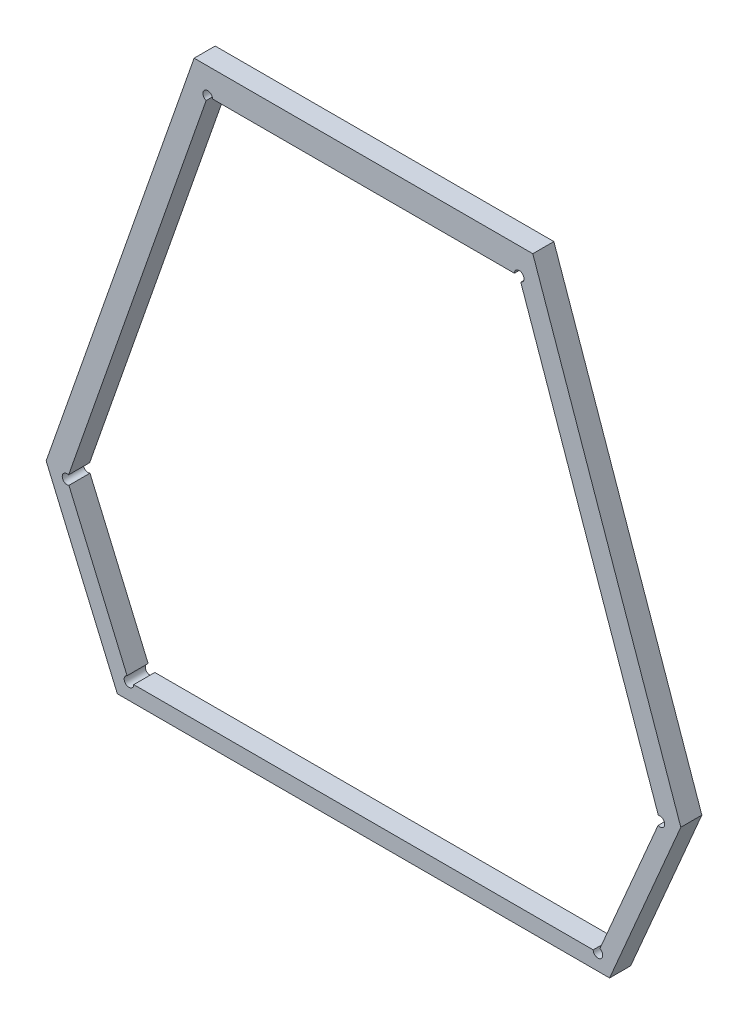
ISO-10303-21;
HEADER;
FILE_DESCRIPTION(('STEP AP214'),'2;1');
FILE_NAME('part.step','',(''),(''),'','','');
FILE_SCHEMA(('AUTOMOTIVE_DESIGN { 1 0 10303 214 1 1 1 1 }'));
ENDSEC;
DATA;
#1=APPLICATION_CONTEXT('core data for automotive mechanical design processes');
#2=APPLICATION_PROTOCOL_DEFINITION('international standard','automotive_design',2000,#1);
#3=PRODUCT_CONTEXT('',#1,'mechanical');
#4=PRODUCT('Part','Part','',(#3));
#5=PRODUCT_RELATED_PRODUCT_CATEGORY('part','',(#4));
#6=PRODUCT_DEFINITION_FORMATION('','',#4);
#7=PRODUCT_DEFINITION_CONTEXT('part definition',#1,'design');
#8=PRODUCT_DEFINITION('design','',#6,#7);
#9=PRODUCT_DEFINITION_SHAPE('','',#8);
#10=(LENGTH_UNIT() NAMED_UNIT(*) SI_UNIT(.MILLI.,.METRE.));
#11=(NAMED_UNIT(*) PLANE_ANGLE_UNIT() SI_UNIT($,.RADIAN.));
#12=(NAMED_UNIT(*) SI_UNIT($,.STERADIAN.) SOLID_ANGLE_UNIT());
#13=UNCERTAINTY_MEASURE_WITH_UNIT(LENGTH_MEASURE(1.E-05),#10,'distance_accuracy_value','');
#14=(GEOMETRIC_REPRESENTATION_CONTEXT(3) GLOBAL_UNCERTAINTY_ASSIGNED_CONTEXT((#13)) GLOBAL_UNIT_ASSIGNED_CONTEXT((#10,
#11,#12)) REPRESENTATION_CONTEXT('',''));
#15=CARTESIAN_POINT('',(0.,0.,0.));
#16=DIRECTION('',(0.,0.,1.));
#17=DIRECTION('',(1.,0.,0.));
#18=AXIS2_PLACEMENT_3D('',#15,#16,#17);
#19=CARTESIAN_POINT('',(-1.3307444469272,-1.3374481361952,0.00415));
#20=DIRECTION('',(0.,0.,1.));
#21=DIRECTION('',(1.,0.,0.));
#22=AXIS2_PLACEMENT_3D('',#19,#20,#21);
#23=PLANE('',#22);
#24=DIRECTION('',(-1.,0.,0.));
#25=VECTOR('',#24,1.);
#26=CARTESIAN_POINT('',(-1.3042082331991,-1.2877662252089,0.00415));
#27=LINE('',#26,#25);
#28=CARTESIAN_POINT('',(-1.3042082331991,-1.2877662252089,0.00415));
#29=VERTEX_POINT('',#28);
#30=CARTESIAN_POINT('',(-1.3572806606553,-1.2877662252089,0.00415));
#31=VERTEX_POINT('',#30);
#32=EDGE_CURVE('E11',#29,#31,#27,.T.);
#33=ORIENTED_EDGE('',*,*,#32,.T.);
#34=DIRECTION('',(-0.330395456277163,-0.943842594118005,0.));
#35=VECTOR('',#34,1.);
#36=CARTESIAN_POINT('',(-1.3572806606553,-1.2877662252089,0.00415));
#37=LINE('',#36,#35);
#38=CARTESIAN_POINT('',(-1.3804697660534,-1.3540106755437,0.00415));
#39=VERTEX_POINT('',#38);
#40=EDGE_CURVE('E24',#31,#39,#37,.T.);
#41=ORIENTED_EDGE('',*,*,#40,.T.);
#42=DIRECTION('',(0.393910865008948,-0.919148644359498,0.));
#43=VECTOR('',#42,1.);
#44=CARTESIAN_POINT('',(-1.3804697660534,-1.3540106755437,0.00415));
#45=LINE('',#44,#43);
#46=CARTESIAN_POINT('',(-1.3693129819663,-1.3800438314681,0.00415));
#47=VERTEX_POINT('',#46);
#48=EDGE_CURVE('E160',#39,#47,#45,.T.);
#49=ORIENTED_EDGE('',*,*,#48,.T.);
#50=DIRECTION('',(1.,0.,0.));
#51=VECTOR('',#50,1.);
#52=CARTESIAN_POINT('',(-1.3693129819663,-1.3800438314681,0.00415));
#53=LINE('',#52,#51);
#54=CARTESIAN_POINT('',(-1.2921759118881,-1.3800438314681,0.00415));
#55=VERTEX_POINT('',#54);
#56=EDGE_CURVE('E266',#47,#55,#53,.T.);
#57=ORIENTED_EDGE('',*,*,#56,.T.);
#58=DIRECTION('',(0.393910865008948,0.919148644359498,0.));
#59=VECTOR('',#58,1.);
#60=CARTESIAN_POINT('',(-1.2921759118881,-1.3800438314681,0.00415));
#61=LINE('',#60,#59);
#62=CARTESIAN_POINT('',(-1.281019127801,-1.3540106755437,0.00415));
#63=VERTEX_POINT('',#62);
#64=EDGE_CURVE('E264',#55,#63,#61,.T.);
#65=ORIENTED_EDGE('',*,*,#64,.T.);
#66=DIRECTION('',(-0.330395456277163,0.943842594118005,0.));
#67=VECTOR('',#66,1.);
#68=CARTESIAN_POINT('',(-1.281019127801,-1.3540106755437,0.00415));
#69=LINE('',#68,#67);
#70=EDGE_CURVE('E262',#63,#29,#69,.T.);
#71=ORIENTED_EDGE('',*,*,#70,.T.);
#72=EDGE_LOOP('',(#33,#41,#49,#57,#65,#71));
#73=FACE_BOUND('',#72,.T.);
#74=DIRECTION('',(-1.,0.,0.));
#75=VECTOR('',#74,1.);
#76=CARTESIAN_POINT('',(-1.3487428118905,-1.3775098681317,0.00415));
#77=LINE('',#76,#75);
#78=CARTESIAN_POINT('',(-1.2947477170004,-1.3775098681317,0.00415));
#79=VERTEX_POINT('',#78);
#80=CARTESIAN_POINT('',(-1.3667411768539,-1.3775098681317,0.00415));
#81=VERTEX_POINT('',#80);
#82=EDGE_CURVE('E260',#79,#81,#77,.T.);
#83=ORIENTED_EDGE('',*,*,#82,.T.);
#84=CARTESIAN_POINT('',(-1.3674911768539,-1.3775098681317,0.00415));
#85=DIRECTION('',(0.,0.,-1.));
#86=DIRECTION('',(0.393910865009024,-0.919148644359465,0.));
#87=AXIS2_PLACEMENT_3D('',#84,#85,#86);
#88=CIRCLE('',#87,0.000749999999999995);
#89=CARTESIAN_POINT('',(-1.3677866100027,-1.3768205066485,0.00415));
#90=VERTEX_POINT('',#89);
#91=EDGE_CURVE('E258',#81,#90,#88,.T.);
#92=ORIENTED_EDGE('',*,*,#91,.T.);
#93=DIRECTION('',(-0.393910865008941,0.919148644359501,0.));
#94=VECTOR('',#93,1.);
#95=CARTESIAN_POINT('',(-1.3765984412098,-1.3562590461054,0.00415));
#96=LINE('',#95,#94);
#97=CARTESIAN_POINT('',(-1.3769026838634,-1.3555491285898,0.00415));
#98=VERTEX_POINT('',#97);
#99=EDGE_CURVE('E256',#90,#98,#96,.T.);
#100=ORIENTED_EDGE('',*,*,#99,.T.);
#101=CARTESIAN_POINT('',(-1.3771981170122,-1.3548597671065,0.00415));
#102=DIRECTION('',(0.,0.,-1.));
#103=DIRECTION('',(-0.330395456277302,-0.943842594117956,0.));
#104=AXIS2_PLACEMENT_3D('',#101,#102,#103);
#105=CIRCLE('',#104,0.000749999999999991);
#106=CARTESIAN_POINT('',(-1.37695032042,-1.354151885161,0.00415));
#107=VERTEX_POINT('',#106);
#108=EDGE_CURVE('E254',#98,#107,#105,.T.);
#109=ORIENTED_EDGE('',*,*,#108,.T.);
#110=DIRECTION('',(0.33039545627716,0.943842594118006,0.));
#111=VECTOR('',#110,1.);
#112=CARTESIAN_POINT('',(-1.3610453573101,-1.3087160858611,0.00415));
#113=LINE('',#112,#111);
#114=CARTESIAN_POINT('',(-1.3553931997035,-1.2925695348222,0.00415));
#115=VERTEX_POINT('',#114);
#116=EDGE_CURVE('E252',#107,#115,#113,.T.);
#117=ORIENTED_EDGE('',*,*,#116,.T.);
#118=CARTESIAN_POINT('',(-1.3551454031113,-1.2918616528766,0.00415));
#119=DIRECTION('',(0.,0.,-1.));
#120=DIRECTION('',(-1.,0.,0.));
#121=AXIS2_PLACEMENT_3D('',#118,#119,#120);
#122=CIRCLE('',#121,0.00075000000000001);
#123=CARTESIAN_POINT('',(-1.3543954031112,-1.2918616528766,0.00415));
#124=VERTEX_POINT('',#123);
#125=EDGE_CURVE('E250',#115,#124,#122,.T.);
#126=ORIENTED_EDGE('',*,*,#125,.T.);
#127=DIRECTION('',(1.,0.,0.));
#128=VECTOR('',#127,1.);
#129=CARTESIAN_POINT('',(-1.3189189688351,-1.2918616528766,0.00415));
#130=LINE('',#129,#128);
#131=CARTESIAN_POINT('',(-1.3070934907431,-1.2918616528766,0.00415));
#132=VERTEX_POINT('',#131);
#133=EDGE_CURVE('E248',#124,#132,#130,.T.);
#134=ORIENTED_EDGE('',*,*,#133,.T.);
#135=CARTESIAN_POINT('',(-1.3063434907431,-1.2918616528766,0.00415));
#136=DIRECTION('',(0.,0.,-1.));
#137=DIRECTION('',(-0.330395456277186,0.943842594117997,0.));
#138=AXIS2_PLACEMENT_3D('',#135,#136,#137);
#139=CIRCLE('',#138,0.000750000000000008);
#140=CARTESIAN_POINT('',(-1.3060956941509,-1.2925695348222,0.00415));
#141=VERTEX_POINT('',#140);
#142=EDGE_CURVE('E246',#132,#141,#139,.T.);
#143=ORIENTED_EDGE('',*,*,#142,.T.);
#144=DIRECTION('',(0.33039545627716,-0.943842594118006,0.));
#145=VECTOR('',#144,1.);
#146=CARTESIAN_POINT('',(-1.289664976186,-1.3395072610305,0.00415));
#147=LINE('',#146,#145);
#148=CARTESIAN_POINT('',(-1.2845385734344,-1.354151885161,0.00415));
#149=VERTEX_POINT('',#148);
#150=EDGE_CURVE('E244',#141,#149,#147,.T.);
#151=ORIENTED_EDGE('',*,*,#150,.T.);
#152=CARTESIAN_POINT('',(-1.2842907768421,-1.3548597671065,0.00415));
#153=DIRECTION('',(0.,0.,-1.));
#154=DIRECTION('',(0.39391086500889,0.919148644359522,0.));
#155=AXIS2_PLACEMENT_3D('',#152,#153,#154);
#156=CIRCLE('',#155,0.000749999999999999);
#157=CARTESIAN_POINT('',(-1.2845862099909,-1.3555491285898,0.00415));
#158=VERTEX_POINT('',#157);
#159=EDGE_CURVE('E242',#149,#158,#156,.T.);
#160=ORIENTED_EDGE('',*,*,#159,.T.);
#161=DIRECTION('',(-0.393910865008941,-0.919148644359501,0.));
#162=VECTOR('',#161,1.);
#163=CARTESIAN_POINT('',(-1.2894484895749,-1.3668947351347,0.00415));
#164=LINE('',#163,#162);
#165=CARTESIAN_POINT('',(-1.2937022838517,-1.3768205066485,0.00415));
#166=VERTEX_POINT('',#165);
#167=EDGE_CURVE('E240',#158,#166,#164,.T.);
#168=ORIENTED_EDGE('',*,*,#167,.T.);
#169=CARTESIAN_POINT('',(-1.2939977170004,-1.3775098681317,0.00415));
#170=DIRECTION('',(0.,0.,-1.));
#171=DIRECTION('',(1.,0.,0.));
#172=AXIS2_PLACEMENT_3D('',#169,#170,#171);
#173=CIRCLE('',#172,0.000750000000000004);
#174=EDGE_CURVE('E237',#166,#79,#173,.T.);
#175=ORIENTED_EDGE('',*,*,#174,.T.);
#176=EDGE_LOOP('',(#83,#92,#100,#109,#117,#126,#134,#143,#151,#160,#168,#175));
#177=FACE_BOUND('',#176,.T.);
#178=ADVANCED_FACE('F17',(#73,#177),#23,.T.);
#179=CARTESIAN_POINT('',(-1.2939977170004,-1.3775098681317,0.00115));
#180=DIRECTION('',(0.,0.,1.));
#181=DIRECTION('',(0.550494838754632,-0.834838566732821,0.));
#182=AXIS2_PLACEMENT_3D('',#179,#180,#181);
#183=CYLINDRICAL_SURFACE('',#182,0.000750000000000004);
#184=DIRECTION('',(0.,0.,1.));
#185=VECTOR('',#184,1.);
#186=CARTESIAN_POINT('',(-1.2937022838517,-1.3768205066485,0.00115));
#187=LINE('',#186,#185);
#188=CARTESIAN_POINT('',(-1.2937022838517,-1.3768205066485,0.00085));
#189=VERTEX_POINT('',#188);
#190=EDGE_CURVE('E234',#189,#166,#187,.T.);
#191=ORIENTED_EDGE('',*,*,#190,.F.);
#192=CARTESIAN_POINT('',(-1.2939977170004,-1.3775098681317,0.00085));
#193=DIRECTION('',(0.,0.,1.));
#194=DIRECTION('',(-1.,0.,0.));
#195=AXIS2_PLACEMENT_3D('',#192,#193,#194);
#196=CIRCLE('',#195,0.000750000000000004);
#197=CARTESIAN_POINT('',(-1.2947477170004,-1.3775098681317,0.00085));
#198=VERTEX_POINT('',#197);
#199=EDGE_CURVE('E232',#198,#189,#196,.T.);
#200=ORIENTED_EDGE('',*,*,#199,.F.);
#201=DIRECTION('',(0.,0.,-1.));
#202=VECTOR('',#201,1.);
#203=CARTESIAN_POINT('',(-1.2947477170004,-1.3775098681317,0.00115));
#204=LINE('',#203,#202);
#205=EDGE_CURVE('E230',#79,#198,#204,.T.);
#206=ORIENTED_EDGE('',*,*,#205,.F.);
#207=ORIENTED_EDGE('',*,*,#174,.F.);
#208=EDGE_LOOP('',(#191,#200,#206,#207));
#209=FACE_BOUND('',#208,.T.);
#210=ADVANCED_FACE('F301',(#209),#183,.F.);
#211=CARTESIAN_POINT('',(-1.3771981170122,-1.3548597671065,0.00115));
#212=DIRECTION('',(0.,0.,1.));
#213=DIRECTION('',(-1.,0.,0.));
#214=AXIS2_PLACEMENT_3D('',#211,#212,#213);
#215=CYLINDRICAL_SURFACE('',#214,0.000749999999999991);
#216=DIRECTION('',(0.,0.,-1.));
#217=VECTOR('',#216,1.);
#218=CARTESIAN_POINT('',(-1.37695032042,-1.354151885161,0.00115));
#219=LINE('',#218,#217);
#220=CARTESIAN_POINT('',(-1.37695032042,-1.354151885161,0.00085));
#221=VERTEX_POINT('',#220);
#222=EDGE_CURVE('E227',#107,#221,#219,.T.);
#223=ORIENTED_EDGE('',*,*,#222,.F.);
#224=ORIENTED_EDGE('',*,*,#108,.F.);
#225=DIRECTION('',(0.,0.,1.));
#226=VECTOR('',#225,1.);
#227=CARTESIAN_POINT('',(-1.3769026838634,-1.3555491285898,0.00115));
#228=LINE('',#227,#226);
#229=CARTESIAN_POINT('',(-1.3769026838634,-1.3555491285898,0.00085));
#230=VERTEX_POINT('',#229);
#231=EDGE_CURVE('E224',#230,#98,#228,.T.);
#232=ORIENTED_EDGE('',*,*,#231,.F.);
#233=CARTESIAN_POINT('',(-1.3771981170122,-1.3548597671065,0.00085));
#234=DIRECTION('',(0.,0.,1.));
#235=DIRECTION('',(-1.,0.,0.));
#236=AXIS2_PLACEMENT_3D('',#233,#234,#235);
#237=CIRCLE('',#236,0.000749999999999991);
#238=EDGE_CURVE('E222',#221,#230,#237,.T.);
#239=ORIENTED_EDGE('',*,*,#238,.F.);
#240=EDGE_LOOP('',(#223,#224,#232,#239));
#241=FACE_BOUND('',#240,.T.);
#242=ADVANCED_FACE('F305',(#241),#215,.F.);
#243=CARTESIAN_POINT('',(-1.3063434907431,-1.2918616528766,0.00115));
#244=DIRECTION('',(0.,0.,1.));
#245=DIRECTION('',(0.578621008831693,0.815596547404778,0.));
#246=AXIS2_PLACEMENT_3D('',#243,#244,#245);
#247=CYLINDRICAL_SURFACE('',#246,0.000750000000000008);
#248=DIRECTION('',(0.,0.,1.));
#249=VECTOR('',#248,1.);
#250=CARTESIAN_POINT('',(-1.3070934907431,-1.2918616528766,0.00115));
#251=LINE('',#250,#249);
#252=CARTESIAN_POINT('',(-1.3070934907431,-1.2918616528766,0.00085));
#253=VERTEX_POINT('',#252);
#254=EDGE_CURVE('E219',#253,#132,#251,.T.);
#255=ORIENTED_EDGE('',*,*,#254,.F.);
#256=CARTESIAN_POINT('',(-1.3063434907431,-1.2918616528766,0.00085));
#257=DIRECTION('',(0.,0.,1.));
#258=DIRECTION('',(-1.,0.,0.));
#259=AXIS2_PLACEMENT_3D('',#256,#257,#258);
#260=CIRCLE('',#259,0.000750000000000008);
#261=CARTESIAN_POINT('',(-1.3060956941509,-1.2925695348222,0.00085));
#262=VERTEX_POINT('',#261);
#263=EDGE_CURVE('E217',#262,#253,#260,.T.);
#264=ORIENTED_EDGE('',*,*,#263,.F.);
#265=DIRECTION('',(0.,0.,-1.));
#266=VECTOR('',#265,1.);
#267=CARTESIAN_POINT('',(-1.3060956941509,-1.2925695348222,0.00115));
#268=LINE('',#267,#266);
#269=EDGE_CURVE('E215',#141,#262,#268,.T.);
#270=ORIENTED_EDGE('',*,*,#269,.F.);
#271=ORIENTED_EDGE('',*,*,#142,.F.);
#272=EDGE_LOOP('',(#255,#264,#270,#271));
#273=FACE_BOUND('',#272,.T.);
#274=ADVANCED_FACE('F310',(#273),#247,.F.);
#275=CARTESIAN_POINT('',(-1.3551454031113,-1.2918616528766,0.00115));
#276=DIRECTION('',(0.,0.,1.));
#277=DIRECTION('',(-1.,0.,0.));
#278=AXIS2_PLACEMENT_3D('',#275,#276,#277);
#279=CYLINDRICAL_SURFACE('',#278,0.00075000000000001);
#280=DIRECTION('',(0.,0.,-1.));
#281=VECTOR('',#280,1.);
#282=CARTESIAN_POINT('',(-1.3543954031112,-1.2918616528766,0.00115));
#283=LINE('',#282,#281);
#284=CARTESIAN_POINT('',(-1.3543954031112,-1.2918616528766,0.00085));
#285=VERTEX_POINT('',#284);
#286=EDGE_CURVE('E212',#124,#285,#283,.T.);
#287=ORIENTED_EDGE('',*,*,#286,.F.);
#288=ORIENTED_EDGE('',*,*,#125,.F.);
#289=DIRECTION('',(0.,0.,1.));
#290=VECTOR('',#289,1.);
#291=CARTESIAN_POINT('',(-1.3553931997035,-1.2925695348222,0.00115));
#292=LINE('',#291,#290);
#293=CARTESIAN_POINT('',(-1.3553931997035,-1.2925695348222,0.00085));
#294=VERTEX_POINT('',#293);
#295=EDGE_CURVE('E209',#294,#115,#292,.T.);
#296=ORIENTED_EDGE('',*,*,#295,.F.);
#297=CARTESIAN_POINT('',(-1.3551454031113,-1.2918616528766,0.00085));
#298=DIRECTION('',(0.,0.,1.));
#299=DIRECTION('',(-1.,0.,0.));
#300=AXIS2_PLACEMENT_3D('',#297,#298,#299);
#301=CIRCLE('',#300,0.00075000000000001);
#302=EDGE_CURVE('E207',#285,#294,#301,.T.);
#303=ORIENTED_EDGE('',*,*,#302,.F.);
#304=EDGE_LOOP('',(#287,#288,#296,#303));
#305=FACE_BOUND('',#304,.T.);
#306=ADVANCED_FACE('F317',(#305),#279,.F.);
#307=CARTESIAN_POINT('',(-1.3674911768539,-1.3775098681317,0.00115));
#308=DIRECTION('',(0.,0.,1.));
#309=DIRECTION('',(-1.,0.,0.));
#310=AXIS2_PLACEMENT_3D('',#307,#308,#309);
#311=CYLINDRICAL_SURFACE('',#310,0.000749999999999995);
#312=DIRECTION('',(0.,0.,1.));
#313=VECTOR('',#312,1.);
#314=CARTESIAN_POINT('',(-1.3667411768539,-1.3775098681317,0.00115));
#315=LINE('',#314,#313);
#316=CARTESIAN_POINT('',(-1.3667411768539,-1.3775098681317,0.00085));
#317=VERTEX_POINT('',#316);
#318=EDGE_CURVE('E204',#317,#81,#315,.T.);
#319=ORIENTED_EDGE('',*,*,#318,.F.);
#320=CARTESIAN_POINT('',(-1.3674911768539,-1.3775098681317,0.00085));
#321=DIRECTION('',(0.,0.,1.));
#322=DIRECTION('',(-1.,0.,0.));
#323=AXIS2_PLACEMENT_3D('',#320,#321,#322);
#324=CIRCLE('',#323,0.000749999999999995);
#325=CARTESIAN_POINT('',(-1.3677866100027,-1.3768205066485,0.00085));
#326=VERTEX_POINT('',#325);
#327=EDGE_CURVE('E202',#326,#317,#324,.T.);
#328=ORIENTED_EDGE('',*,*,#327,.F.);
#329=DIRECTION('',(0.,0.,1.));
#330=VECTOR('',#329,1.);
#331=CARTESIAN_POINT('',(-1.3677866100027,-1.3768205066485,0.00115));
#332=LINE('',#331,#330);
#333=EDGE_CURVE('E199',#326,#90,#332,.T.);
#334=ORIENTED_EDGE('',*,*,#333,.T.);
#335=ORIENTED_EDGE('',*,*,#91,.F.);
#336=EDGE_LOOP('',(#319,#328,#334,#335));
#337=FACE_BOUND('',#336,.T.);
#338=ADVANCED_FACE('F321',(#337),#311,.F.);
#339=CARTESIAN_POINT('',(-1.2842907768421,-1.3548597671065,0.00115));
#340=DIRECTION('',(0.,0.,1.));
#341=DIRECTION('',(0.99941933162449,-0.0340734438420617,0.));
#342=AXIS2_PLACEMENT_3D('',#339,#340,#341);
#343=CYLINDRICAL_SURFACE('',#342,0.000749999999999999);
#344=DIRECTION('',(0.,0.,1.));
#345=VECTOR('',#344,1.);
#346=CARTESIAN_POINT('',(-1.2845385734344,-1.354151885161,0.00115));
#347=LINE('',#346,#345);
#348=CARTESIAN_POINT('',(-1.2845385734344,-1.354151885161,0.00085));
#349=VERTEX_POINT('',#348);
#350=EDGE_CURVE('E196',#349,#149,#347,.T.);
#351=ORIENTED_EDGE('',*,*,#350,.F.);
#352=CARTESIAN_POINT('',(-1.2842907768421,-1.3548597671065,0.00085));
#353=DIRECTION('',(0.,0.,1.));
#354=DIRECTION('',(-1.,0.,0.));
#355=AXIS2_PLACEMENT_3D('',#352,#353,#354);
#356=CIRCLE('',#355,0.000749999999999999);
#357=CARTESIAN_POINT('',(-1.2845862099909,-1.3555491285898,0.00085));
#358=VERTEX_POINT('',#357);
#359=EDGE_CURVE('E194',#358,#349,#356,.T.);
#360=ORIENTED_EDGE('',*,*,#359,.F.);
#361=DIRECTION('',(0.,0.,-1.));
#362=VECTOR('',#361,1.);
#363=CARTESIAN_POINT('',(-1.2845862099909,-1.3555491285898,0.00115));
#364=LINE('',#363,#362);
#365=EDGE_CURVE('E192',#158,#358,#364,.T.);
#366=ORIENTED_EDGE('',*,*,#365,.F.);
#367=ORIENTED_EDGE('',*,*,#159,.F.);
#368=EDGE_LOOP('',(#351,#360,#366,#367));
#369=FACE_BOUND('',#368,.T.);
#370=ADVANCED_FACE('F325',(#369),#343,.F.);
#371=CARTESIAN_POINT('',(-1.3771981170122,-1.3548597671065,0.00085));
#372=DIRECTION('',(-0.919148644359501,-0.393910865008941,0.));
#373=DIRECTION('',(0.393910865008941,-0.919148644359501,0.));
#374=AXIS2_PLACEMENT_3D('',#371,#372,#373);
#375=PLANE('',#374);
#376=ORIENTED_EDGE('',*,*,#231,.T.);
#377=ORIENTED_EDGE('',*,*,#99,.F.);
#378=ORIENTED_EDGE('',*,*,#333,.F.);
#379=DIRECTION('',(0.393910865008941,-0.919148644359501,0.));
#380=VECTOR('',#379,1.);
#381=CARTESIAN_POINT('',(-1.3771981170122,-1.3548597671065,0.00085));
#382=LINE('',#381,#380);
#383=EDGE_CURVE('E189',#230,#326,#382,.T.);
#384=ORIENTED_EDGE('',*,*,#383,.F.);
#385=EDGE_LOOP('',(#376,#377,#378,#384));
#386=FACE_BOUND('',#385,.T.);
#387=ADVANCED_FACE('F329',(#386),#375,.F.);
#388=CARTESIAN_POINT('',(-1.2939977170004,-1.3775098681317,0.00085));
#389=DIRECTION('',(0.,1.,0.));
#390=DIRECTION('',(-1.,0.,0.));
#391=AXIS2_PLACEMENT_3D('',#388,#389,#390);
#392=PLANE('',#391);
#393=ORIENTED_EDGE('',*,*,#205,.T.);
#394=DIRECTION('',(-1.,0.,0.));
#395=VECTOR('',#394,1.);
#396=CARTESIAN_POINT('',(-1.2939977170004,-1.3775098681317,0.00085));
#397=LINE('',#396,#395);
#398=EDGE_CURVE('E186',#198,#317,#397,.T.);
#399=ORIENTED_EDGE('',*,*,#398,.T.);
#400=ORIENTED_EDGE('',*,*,#318,.T.);
#401=ORIENTED_EDGE('',*,*,#82,.F.);
#402=EDGE_LOOP('',(#393,#399,#400,#401));
#403=FACE_BOUND('',#402,.T.);
#404=ADVANCED_FACE('F333',(#403),#392,.T.);
#405=CARTESIAN_POINT('',(-1.3016685363949,-1.3375636474539,0.00085));
#406=DIRECTION('',(0.,0.,1.));
#407=DIRECTION('',(1.,0.,0.));
#408=AXIS2_PLACEMENT_3D('',#405,#406,#407);
#409=PLANE('',#408);
#410=DIRECTION('',(-1.,0.,0.));
#411=VECTOR('',#410,1.);
#412=CARTESIAN_POINT('',(-1.3042082331991,-1.2877662252089,0.00085));
#413=LINE('',#412,#411);
#414=CARTESIAN_POINT('',(-1.3042082331991,-1.2877662252089,0.00085));
#415=VERTEX_POINT('',#414);
#416=CARTESIAN_POINT('',(-1.3572806606553,-1.2877662252089,0.00085));
#417=VERTEX_POINT('',#416);
#418=EDGE_CURVE('E184',#415,#417,#413,.T.);
#419=ORIENTED_EDGE('',*,*,#418,.F.);
#420=DIRECTION('',(-0.33039545627716,0.943842594118006,0.));
#421=VECTOR('',#420,1.);
#422=CARTESIAN_POINT('',(-1.281019127801,-1.3540106755437,0.00085));
#423=LINE('',#422,#421);
#424=CARTESIAN_POINT('',(-1.281019127801,-1.3540106755437,0.00085));
#425=VERTEX_POINT('',#424);
#426=EDGE_CURVE('E181',#425,#415,#423,.T.);
#427=ORIENTED_EDGE('',*,*,#426,.F.);
#428=DIRECTION('',(0.393910865008941,0.919148644359501,0.));
#429=VECTOR('',#428,1.);
#430=CARTESIAN_POINT('',(-1.2921759118881,-1.3800438314681,0.00085));
#431=LINE('',#430,#429);
#432=CARTESIAN_POINT('',(-1.2921759118881,-1.3800438314681,0.00085));
#433=VERTEX_POINT('',#432);
#434=EDGE_CURVE('E178',#433,#425,#431,.T.);
#435=ORIENTED_EDGE('',*,*,#434,.F.);
#436=DIRECTION('',(-1.,0.,0.));
#437=VECTOR('',#436,1.);
#438=CARTESIAN_POINT('',(-1.3307444469272,-1.3800438314681,0.00085));
#439=LINE('',#438,#437);
#440=CARTESIAN_POINT('',(-1.3693129819663,-1.3800438314681,0.00085));
#441=VERTEX_POINT('',#440);
#442=EDGE_CURVE('E145',#433,#441,#439,.T.);
#443=ORIENTED_EDGE('',*,*,#442,.T.);
#444=DIRECTION('',(-0.393910865008941,0.919148644359501,0.));
#445=VECTOR('',#444,1.);
#446=CARTESIAN_POINT('',(-1.3693129819663,-1.3800438314681,0.00085));
#447=LINE('',#446,#445);
#448=CARTESIAN_POINT('',(-1.3804697660534,-1.3540106755437,0.00085));
#449=VERTEX_POINT('',#448);
#450=EDGE_CURVE('E138',#441,#449,#447,.T.);
#451=ORIENTED_EDGE('',*,*,#450,.T.);
#452=DIRECTION('',(0.33039545627716,0.943842594118006,0.));
#453=VECTOR('',#452,1.);
#454=CARTESIAN_POINT('',(-1.3804697660534,-1.3540106755437,0.00085));
#455=LINE('',#454,#453);
#456=EDGE_CURVE('E142',#449,#417,#455,.T.);
#457=ORIENTED_EDGE('',*,*,#456,.T.);
#458=EDGE_LOOP('',(#419,#427,#435,#443,#451,#457));
#459=FACE_BOUND('',#458,.T.);
#460=ORIENTED_EDGE('',*,*,#199,.T.);
#461=DIRECTION('',(-0.393910865008941,-0.919148644359501,0.));
#462=VECTOR('',#461,1.);
#463=CARTESIAN_POINT('',(-1.2842907768421,-1.3548597671065,0.00085));
#464=LINE('',#463,#462);
#465=EDGE_CURVE('E156',#358,#189,#464,.T.);
#466=ORIENTED_EDGE('',*,*,#465,.F.);
#467=ORIENTED_EDGE('',*,*,#359,.T.);
#468=DIRECTION('',(0.330395456277161,-0.943842594118006,0.));
#469=VECTOR('',#468,1.);
#470=CARTESIAN_POINT('',(-1.3063434907431,-1.2918616528766,0.00085));
#471=LINE('',#470,#469);
#472=EDGE_CURVE('E172',#262,#349,#471,.T.);
#473=ORIENTED_EDGE('',*,*,#472,.F.);
#474=ORIENTED_EDGE('',*,*,#263,.T.);
#475=DIRECTION('',(1.,0.,0.));
#476=VECTOR('',#475,1.);
#477=CARTESIAN_POINT('',(-1.3307444469272,-1.2918616528766,0.00085));
#478=LINE('',#477,#476);
#479=EDGE_CURVE('E164',#285,#253,#478,.T.);
#480=ORIENTED_EDGE('',*,*,#479,.F.);
#481=ORIENTED_EDGE('',*,*,#302,.T.);
#482=DIRECTION('',(-0.330395456277161,-0.943842594118006,0.));
#483=VECTOR('',#482,1.);
#484=CARTESIAN_POINT('',(-1.3551454031113,-1.2918616528766,0.00085));
#485=LINE('',#484,#483);
#486=EDGE_CURVE('E161',#294,#221,#485,.T.);
#487=ORIENTED_EDGE('',*,*,#486,.T.);
#488=ORIENTED_EDGE('',*,*,#238,.T.);
#489=ORIENTED_EDGE('',*,*,#383,.T.);
#490=ORIENTED_EDGE('',*,*,#327,.T.);
#491=ORIENTED_EDGE('',*,*,#398,.F.);
#492=EDGE_LOOP('',(#460,#466,#467,#473,#474,#480,#481,#487,#488,#489,#490,#491));
#493=FACE_BOUND('',#492,.T.);
#494=ADVANCED_FACE('F140',(#459,#493),#409,.F.);
#495=CARTESIAN_POINT('',(-1.3063434907431,-1.2918616528766,0.00085));
#496=DIRECTION('',(-0.943842594118006,-0.330395456277161,0.));
#497=DIRECTION('',(0.330395456277161,-0.943842594118006,0.));
#498=AXIS2_PLACEMENT_3D('',#495,#496,#497);
#499=PLANE('',#498);
#500=ORIENTED_EDGE('',*,*,#269,.T.);
#501=ORIENTED_EDGE('',*,*,#472,.T.);
#502=ORIENTED_EDGE('',*,*,#350,.T.);
#503=ORIENTED_EDGE('',*,*,#150,.F.);
#504=EDGE_LOOP('',(#500,#501,#502,#503));
#505=FACE_BOUND('',#504,.T.);
#506=ADVANCED_FACE('F340',(#505),#499,.T.);
#507=CARTESIAN_POINT('',(-1.3804697660534,-1.3540106755437,0.00085));
#508=DIRECTION('',(0.943842594118006,-0.33039545627716,0.));
#509=DIRECTION('',(0.33039545627716,0.943842594118006,0.));
#510=AXIS2_PLACEMENT_3D('',#507,#508,#509);
#511=PLANE('',#510);
#512=ORIENTED_EDGE('',*,*,#456,.F.);
#513=DIRECTION('',(0.,0.,1.));
#514=VECTOR('',#513,1.);
#515=CARTESIAN_POINT('',(-1.3804697660534,-1.3540106755437,0.00085));
#516=LINE('',#515,#514);
#517=EDGE_CURVE('E154',#449,#39,#516,.T.);
#518=ORIENTED_EDGE('',*,*,#517,.T.);
#519=ORIENTED_EDGE('',*,*,#40,.F.);
#520=DIRECTION('',(0.,0.,1.));
#521=VECTOR('',#520,1.);
#522=CARTESIAN_POINT('',(-1.3572806606553,-1.2877662252089,0.00085));
#523=LINE('',#522,#521);
#524=EDGE_CURVE('E155',#417,#31,#523,.T.);
#525=ORIENTED_EDGE('',*,*,#524,.F.);
#526=EDGE_LOOP('',(#512,#518,#519,#525));
#527=FACE_BOUND('',#526,.T.);
#528=ADVANCED_FACE('F153',(#527),#511,.F.);
#529=CARTESIAN_POINT('',(-1.3693129819663,-1.3800438314681,0.00085));
#530=DIRECTION('',(0.919148644359501,0.393910865008941,0.));
#531=DIRECTION('',(-0.393910865008941,0.919148644359501,0.));
#532=AXIS2_PLACEMENT_3D('',#529,#530,#531);
#533=PLANE('',#532);
#534=ORIENTED_EDGE('',*,*,#450,.F.);
#535=DIRECTION('',(0.,0.,1.));
#536=VECTOR('',#535,1.);
#537=CARTESIAN_POINT('',(-1.3693129819663,-1.3800438314681,0.00085));
#538=LINE('',#537,#536);
#539=EDGE_CURVE('E166',#441,#47,#538,.T.);
#540=ORIENTED_EDGE('',*,*,#539,.T.);
#541=ORIENTED_EDGE('',*,*,#48,.F.);
#542=ORIENTED_EDGE('',*,*,#517,.F.);
#543=EDGE_LOOP('',(#534,#540,#541,#542));
#544=FACE_BOUND('',#543,.T.);
#545=ADVANCED_FACE('F159',(#544),#533,.F.);
#546=CARTESIAN_POINT('',(-1.3551454031113,-1.2918616528766,0.00085));
#547=DIRECTION('',(-0.943842594118006,0.330395456277161,0.));
#548=DIRECTION('',(-0.330395456277161,-0.943842594118006,0.));
#549=AXIS2_PLACEMENT_3D('',#546,#547,#548);
#550=PLANE('',#549);
#551=ORIENTED_EDGE('',*,*,#222,.T.);
#552=ORIENTED_EDGE('',*,*,#486,.F.);
#553=ORIENTED_EDGE('',*,*,#295,.T.);
#554=ORIENTED_EDGE('',*,*,#116,.F.);
#555=EDGE_LOOP('',(#551,#552,#553,#554));
#556=FACE_BOUND('',#555,.T.);
#557=ADVANCED_FACE('F348',(#556),#550,.F.);
#558=CARTESIAN_POINT('',(-1.3042082331991,-1.2877662252089,0.00085));
#559=DIRECTION('',(0.,1.,0.));
#560=DIRECTION('',(-1.,0.,0.));
#561=AXIS2_PLACEMENT_3D('',#558,#559,#560);
#562=PLANE('',#561);
#563=ORIENTED_EDGE('',*,*,#418,.T.);
#564=ORIENTED_EDGE('',*,*,#524,.T.);
#565=ORIENTED_EDGE('',*,*,#32,.F.);
#566=DIRECTION('',(0.,0.,1.));
#567=VECTOR('',#566,1.);
#568=CARTESIAN_POINT('',(-1.3042082331991,-1.2877662252089,0.00085));
#569=LINE('',#568,#567);
#570=EDGE_CURVE('E272',#415,#29,#569,.T.);
#571=ORIENTED_EDGE('',*,*,#570,.F.);
#572=EDGE_LOOP('',(#563,#564,#565,#571));
#573=FACE_BOUND('',#572,.T.);
#574=ADVANCED_FACE('F270',(#573),#562,.T.);
#575=CARTESIAN_POINT('',(-1.281019127801,-1.3540106755437,0.00085));
#576=DIRECTION('',(0.943842594118006,0.33039545627716,0.));
#577=DIRECTION('',(-0.33039545627716,0.943842594118006,0.));
#578=AXIS2_PLACEMENT_3D('',#575,#576,#577);
#579=PLANE('',#578);
#580=ORIENTED_EDGE('',*,*,#426,.T.);
#581=ORIENTED_EDGE('',*,*,#570,.T.);
#582=ORIENTED_EDGE('',*,*,#70,.F.);
#583=DIRECTION('',(0.,0.,1.));
#584=VECTOR('',#583,1.);
#585=CARTESIAN_POINT('',(-1.281019127801,-1.3540106755437,0.00085));
#586=LINE('',#585,#584);
#587=EDGE_CURVE('E278',#425,#63,#586,.T.);
#588=ORIENTED_EDGE('',*,*,#587,.F.);
#589=EDGE_LOOP('',(#580,#581,#582,#588));
#590=FACE_BOUND('',#589,.T.);
#591=ADVANCED_FACE('F275',(#590),#579,.T.);
#592=CARTESIAN_POINT('',(-1.2921759118881,-1.3800438314681,0.00085));
#593=DIRECTION('',(0.919148644359501,-0.393910865008941,0.));
#594=DIRECTION('',(0.393910865008941,0.919148644359501,0.));
#595=AXIS2_PLACEMENT_3D('',#592,#593,#594);
#596=PLANE('',#595);
#597=ORIENTED_EDGE('',*,*,#434,.T.);
#598=ORIENTED_EDGE('',*,*,#587,.T.);
#599=ORIENTED_EDGE('',*,*,#64,.F.);
#600=DIRECTION('',(0.,0.,1.));
#601=VECTOR('',#600,1.);
#602=CARTESIAN_POINT('',(-1.2921759118881,-1.3800438314681,0.00085));
#603=LINE('',#602,#601);
#604=EDGE_CURVE('E281',#433,#55,#603,.T.);
#605=ORIENTED_EDGE('',*,*,#604,.F.);
#606=EDGE_LOOP('',(#597,#598,#599,#605));
#607=FACE_BOUND('',#606,.T.);
#608=ADVANCED_FACE('F289',(#607),#596,.T.);
#609=CARTESIAN_POINT('',(-1.3307444469272,-1.3800438314681,0.00085));
#610=DIRECTION('',(0.,-1.,0.));
#611=DIRECTION('',(1.,0.,0.));
#612=AXIS2_PLACEMENT_3D('',#609,#610,#611);
#613=PLANE('',#612);
#614=ORIENTED_EDGE('',*,*,#442,.F.);
#615=ORIENTED_EDGE('',*,*,#604,.T.);
#616=ORIENTED_EDGE('',*,*,#56,.F.);
#617=ORIENTED_EDGE('',*,*,#539,.F.);
#618=EDGE_LOOP('',(#614,#615,#616,#617));
#619=FACE_BOUND('',#618,.T.);
#620=ADVANCED_FACE('F287',(#619),#613,.T.);
#621=CARTESIAN_POINT('',(-1.2842907768421,-1.3548597671065,0.00085));
#622=DIRECTION('',(-0.919148644359501,0.393910865008941,0.));
#623=DIRECTION('',(-0.393910865008941,-0.919148644359501,0.));
#624=AXIS2_PLACEMENT_3D('',#621,#622,#623);
#625=PLANE('',#624);
#626=ORIENTED_EDGE('',*,*,#190,.T.);
#627=ORIENTED_EDGE('',*,*,#167,.F.);
#628=ORIENTED_EDGE('',*,*,#365,.T.);
#629=ORIENTED_EDGE('',*,*,#465,.T.);
#630=EDGE_LOOP('',(#626,#627,#628,#629));
#631=FACE_BOUND('',#630,.T.);
#632=ADVANCED_FACE('F297',(#631),#625,.T.);
#633=CARTESIAN_POINT('',(-1.3307444469272,-1.2918616528766,0.00085));
#634=DIRECTION('',(0.,-1.,0.));
#635=DIRECTION('',(1.,0.,0.));
#636=AXIS2_PLACEMENT_3D('',#633,#634,#635);
#637=PLANE('',#636);
#638=ORIENTED_EDGE('',*,*,#254,.T.);
#639=ORIENTED_EDGE('',*,*,#133,.F.);
#640=ORIENTED_EDGE('',*,*,#286,.T.);
#641=ORIENTED_EDGE('',*,*,#479,.T.);
#642=EDGE_LOOP('',(#638,#639,#640,#641));
#643=FACE_BOUND('',#642,.T.);
#644=ADVANCED_FACE('F388',(#643),#637,.T.);
#645=CLOSED_SHELL('',(#178,#210,#242,#274,#306,#338,#370,#387,#404,#494,#506,#528,#545,#557,
#574,#591,#608,#620,#632,#644));
#646=MANIFOLD_SOLID_BREP('B1',#645);
#647=ADVANCED_BREP_SHAPE_REPRESENTATION('',(#18,#646),#14);
#648=SHAPE_DEFINITION_REPRESENTATION(#9,#647);
ENDSEC;
END-ISO-10303-21;
